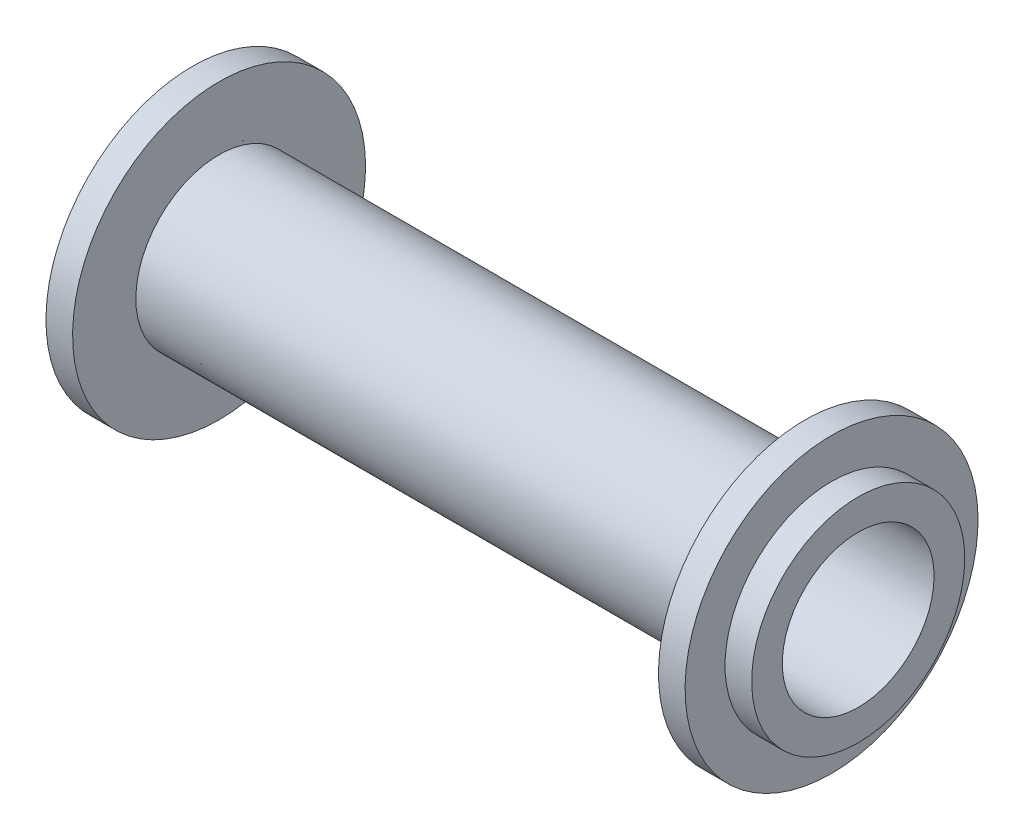
ISO-10303-21;
HEADER;
FILE_DESCRIPTION(('STEP AP214'),'2;1');
FILE_NAME('part.step','',(''),(''),'','','');
FILE_SCHEMA(('AUTOMOTIVE_DESIGN { 1 0 10303 214 1 1 1 1 }'));
ENDSEC;
DATA;
#1=APPLICATION_CONTEXT('core data for automotive mechanical design processes');
#2=APPLICATION_PROTOCOL_DEFINITION('international standard','automotive_design',2000,#1);
#3=PRODUCT_CONTEXT('',#1,'mechanical');
#4=PRODUCT('Part','Part','',(#3));
#5=PRODUCT_RELATED_PRODUCT_CATEGORY('part','',(#4));
#6=PRODUCT_DEFINITION_FORMATION('','',#4);
#7=PRODUCT_DEFINITION_CONTEXT('part definition',#1,'design');
#8=PRODUCT_DEFINITION('design','',#6,#7);
#9=PRODUCT_DEFINITION_SHAPE('','',#8);
#10=(LENGTH_UNIT() NAMED_UNIT(*) SI_UNIT(.MILLI.,.METRE.));
#11=(NAMED_UNIT(*) PLANE_ANGLE_UNIT() SI_UNIT($,.RADIAN.));
#12=(NAMED_UNIT(*) SI_UNIT($,.STERADIAN.) SOLID_ANGLE_UNIT());
#13=UNCERTAINTY_MEASURE_WITH_UNIT(LENGTH_MEASURE(1.E-05),#10,'distance_accuracy_value','');
#14=(GEOMETRIC_REPRESENTATION_CONTEXT(3) GLOBAL_UNCERTAINTY_ASSIGNED_CONTEXT((#13)) GLOBAL_UNIT_ASSIGNED_CONTEXT((#10,
#11,#12)) REPRESENTATION_CONTEXT('',''));
#15=CARTESIAN_POINT('',(0.,0.,0.));
#16=DIRECTION('',(0.,0.,1.));
#17=DIRECTION('',(1.,0.,0.));
#18=AXIS2_PLACEMENT_3D('',#15,#16,#17);
#19=CARTESIAN_POINT('',(-24.,0.,0.));
#20=DIRECTION('',(1.,0.,0.));
#21=DIRECTION('',(0.,1.,0.));
#22=AXIS2_PLACEMENT_3D('',#19,#20,#21);
#23=PLANE('',#22);
#24=CARTESIAN_POINT('',(-24.,0.,0.));
#25=DIRECTION('',(-1.,0.,0.));
#26=DIRECTION('',(0.,-1.,0.));
#27=AXIS2_PLACEMENT_3D('',#24,#25,#26);
#28=CIRCLE('',#27,11.);
#29=CARTESIAN_POINT('',(-24.,-11.,0.));
#30=VERTEX_POINT('',#29);
#31=EDGE_CURVE('E40',#30,#30,#28,.T.);
#32=ORIENTED_EDGE('',*,*,#31,.T.);
#33=EDGE_LOOP('',(#32));
#34=FACE_BOUND('',#33,.T.);
#35=CARTESIAN_POINT('',(-24.,0.,0.));
#36=DIRECTION('',(1.,0.,0.));
#37=DIRECTION('',(0.,1.,0.));
#38=AXIS2_PLACEMENT_3D('',#35,#36,#37);
#39=CIRCLE('',#38,8.);
#40=CARTESIAN_POINT('',(-24.,8.,0.));
#41=VERTEX_POINT('',#40);
#42=EDGE_CURVE('E10',#41,#41,#39,.F.);
#43=ORIENTED_EDGE('',*,*,#42,.F.);
#44=EDGE_LOOP('',(#43));
#45=FACE_BOUND('',#44,.T.);
#46=ADVANCED_FACE('F30',(#34,#45),#23,.F.);
#47=CARTESIAN_POINT('',(24.,0.,0.));
#48=DIRECTION('',(-1.,0.,0.));
#49=DIRECTION('',(0.,-1.,0.));
#50=AXIS2_PLACEMENT_3D('',#47,#48,#49);
#51=PLANE('',#50);
#52=CARTESIAN_POINT('',(24.,0.,0.));
#53=DIRECTION('',(-1.,0.,0.));
#54=DIRECTION('',(0.,-1.,0.));
#55=AXIS2_PLACEMENT_3D('',#52,#53,#54);
#56=CIRCLE('',#55,11.);
#57=CARTESIAN_POINT('',(24.,-11.,0.));
#58=VERTEX_POINT('',#57);
#59=EDGE_CURVE('E58',#58,#58,#56,.T.);
#60=ORIENTED_EDGE('',*,*,#59,.F.);
#61=EDGE_LOOP('',(#60));
#62=FACE_BOUND('',#61,.T.);
#63=CARTESIAN_POINT('',(24.,0.,0.));
#64=DIRECTION('',(-1.,0.,0.));
#65=DIRECTION('',(0.,-1.,0.));
#66=AXIS2_PLACEMENT_3D('',#63,#64,#65);
#67=CIRCLE('',#66,8.);
#68=CARTESIAN_POINT('',(24.,-8.,0.));
#69=VERTEX_POINT('',#68);
#70=EDGE_CURVE('E36',#69,#69,#67,.F.);
#71=ORIENTED_EDGE('',*,*,#70,.F.);
#72=EDGE_LOOP('',(#71));
#73=FACE_BOUND('',#72,.T.);
#74=ADVANCED_FACE('F92',(#62,#73),#51,.F.);
#75=CARTESIAN_POINT('',(-24.,0.,0.));
#76=DIRECTION('',(-1.,0.,0.));
#77=DIRECTION('',(0.,-1.,0.));
#78=AXIS2_PLACEMENT_3D('',#75,#76,#77);
#79=CYLINDRICAL_SURFACE('',#78,11.);
#80=ORIENTED_EDGE('',*,*,#31,.F.);
#81=EDGE_LOOP('',(#80));
#82=FACE_BOUND('',#81,.T.);
#83=CARTESIAN_POINT('',(-22.,0.,0.));
#84=DIRECTION('',(-1.,0.,0.));
#85=DIRECTION('',(0.,-1.,0.));
#86=AXIS2_PLACEMENT_3D('',#83,#84,#85);
#87=CIRCLE('',#86,11.);
#88=CARTESIAN_POINT('',(-22.,-11.,0.));
#89=VERTEX_POINT('',#88);
#90=EDGE_CURVE('E44',#89,#89,#87,.T.);
#91=ORIENTED_EDGE('',*,*,#90,.T.);
#92=EDGE_LOOP('',(#91));
#93=FACE_BOUND('',#92,.T.);
#94=ADVANCED_FACE('F97',(#82,#93),#79,.T.);
#95=CARTESIAN_POINT('',(-22.,11.,0.));
#96=DIRECTION('',(-1.,0.,0.));
#97=DIRECTION('',(0.,-1.,0.));
#98=AXIS2_PLACEMENT_3D('',#95,#96,#97);
#99=PLANE('',#98);
#100=ORIENTED_EDGE('',*,*,#90,.F.);
#101=EDGE_LOOP('',(#100));
#102=FACE_BOUND('',#101,.T.);
#103=CARTESIAN_POINT('',(-22.,0.,0.));
#104=DIRECTION('',(-1.,0.,0.));
#105=DIRECTION('',(0.,-1.,0.));
#106=AXIS2_PLACEMENT_3D('',#103,#104,#105);
#107=CIRCLE('',#106,6.25);
#108=CARTESIAN_POINT('',(-22.,-6.25,0.));
#109=VERTEX_POINT('',#108);
#110=EDGE_CURVE('E49',#109,#109,#107,.T.);
#111=ORIENTED_EDGE('',*,*,#110,.T.);
#112=EDGE_LOOP('',(#111));
#113=FACE_BOUND('',#112,.T.);
#114=ADVANCED_FACE('F105',(#102,#113),#99,.F.);
#115=CARTESIAN_POINT('',(-24.,0.,0.));
#116=DIRECTION('',(-1.,0.,0.));
#117=DIRECTION('',(0.,-1.,0.));
#118=AXIS2_PLACEMENT_3D('',#115,#116,#117);
#119=CYLINDRICAL_SURFACE('',#118,6.25);
#120=ORIENTED_EDGE('',*,*,#110,.F.);
#121=EDGE_LOOP('',(#120));
#122=FACE_BOUND('',#121,.T.);
#123=CARTESIAN_POINT('',(21.9999999999999,0.,0.));
#124=DIRECTION('',(-1.,0.,0.));
#125=DIRECTION('',(0.,-1.,0.));
#126=AXIS2_PLACEMENT_3D('',#123,#124,#125);
#127=CIRCLE('',#126,6.25);
#128=CARTESIAN_POINT('',(21.9999999999999,-6.24999999999999,0.));
#129=VERTEX_POINT('',#128);
#130=EDGE_CURVE('E52',#129,#129,#127,.T.);
#131=ORIENTED_EDGE('',*,*,#130,.T.);
#132=EDGE_LOOP('',(#131));
#133=FACE_BOUND('',#132,.T.);
#134=ADVANCED_FACE('F110',(#122,#133),#119,.T.);
#135=CARTESIAN_POINT('',(22.,11.,0.));
#136=DIRECTION('',(1.,0.,0.));
#137=DIRECTION('',(0.,1.,0.));
#138=AXIS2_PLACEMENT_3D('',#135,#136,#137);
#139=PLANE('',#138);
#140=ORIENTED_EDGE('',*,*,#130,.F.);
#141=EDGE_LOOP('',(#140));
#142=FACE_BOUND('',#141,.T.);
#143=CARTESIAN_POINT('',(22.,0.,0.));
#144=DIRECTION('',(-1.,0.,0.));
#145=DIRECTION('',(0.,-1.,0.));
#146=AXIS2_PLACEMENT_3D('',#143,#144,#145);
#147=CIRCLE('',#146,11.);
#148=CARTESIAN_POINT('',(22.,-11.,0.));
#149=VERTEX_POINT('',#148);
#150=EDGE_CURVE('E55',#149,#149,#147,.T.);
#151=ORIENTED_EDGE('',*,*,#150,.T.);
#152=EDGE_LOOP('',(#151));
#153=FACE_BOUND('',#152,.T.);
#154=ADVANCED_FACE('F116',(#142,#153),#139,.F.);
#155=CARTESIAN_POINT('',(-24.,0.,0.));
#156=DIRECTION('',(-1.,0.,0.));
#157=DIRECTION('',(0.,-1.,0.));
#158=AXIS2_PLACEMENT_3D('',#155,#156,#157);
#159=CYLINDRICAL_SURFACE('',#158,11.);
#160=ORIENTED_EDGE('',*,*,#150,.F.);
#161=EDGE_LOOP('',(#160));
#162=FACE_BOUND('',#161,.T.);
#163=ORIENTED_EDGE('',*,*,#59,.T.);
#164=EDGE_LOOP('',(#163));
#165=FACE_BOUND('',#164,.T.);
#166=ADVANCED_FACE('F122',(#162,#165),#159,.T.);
#167=CARTESIAN_POINT('',(-24.,0.,0.));
#168=DIRECTION('',(1.,0.,0.));
#169=DIRECTION('',(0.,0.,-1.));
#170=AXIS2_PLACEMENT_3D('',#167,#168,#169);
#171=CYLINDRICAL_SURFACE('',#170,5.7);
#172=CARTESIAN_POINT('',(26.,0.,0.));
#173=DIRECTION('',(1.,0.,0.));
#174=DIRECTION('',(0.,0.,-1.));
#175=AXIS2_PLACEMENT_3D('',#172,#173,#174);
#176=CIRCLE('',#175,5.7);
#177=CARTESIAN_POINT('',(26.,0.,-5.7));
#178=VERTEX_POINT('',#177);
#179=EDGE_CURVE('E64',#178,#178,#176,.T.);
#180=ORIENTED_EDGE('',*,*,#179,.T.);
#181=EDGE_LOOP('',(#180));
#182=FACE_BOUND('',#181,.T.);
#183=CARTESIAN_POINT('',(-26.,0.,0.));
#184=DIRECTION('',(-1.,0.,0.));
#185=DIRECTION('',(0.,0.,1.));
#186=AXIS2_PLACEMENT_3D('',#183,#184,#185);
#187=CIRCLE('',#186,5.7);
#188=CARTESIAN_POINT('',(-26.,0.,5.7));
#189=VERTEX_POINT('',#188);
#190=EDGE_CURVE('E70',#189,#189,#187,.T.);
#191=ORIENTED_EDGE('',*,*,#190,.T.);
#192=EDGE_LOOP('',(#191));
#193=FACE_BOUND('',#192,.T.);
#194=ADVANCED_FACE('F74',(#182,#193),#171,.F.);
#195=CARTESIAN_POINT('',(26.,0.,0.));
#196=DIRECTION('',(1.,0.,0.));
#197=DIRECTION('',(0.,0.,-1.));
#198=AXIS2_PLACEMENT_3D('',#195,#196,#197);
#199=PLANE('',#198);
#200=CARTESIAN_POINT('',(26.,0.,0.));
#201=DIRECTION('',(1.,0.,0.));
#202=DIRECTION('',(0.,0.,-1.));
#203=AXIS2_PLACEMENT_3D('',#200,#201,#202);
#204=CIRCLE('',#203,8.);
#205=CARTESIAN_POINT('',(26.,0.,-8.));
#206=VERTEX_POINT('',#205);
#207=EDGE_CURVE('E61',#206,#206,#204,.T.);
#208=ORIENTED_EDGE('',*,*,#207,.T.);
#209=EDGE_LOOP('',(#208));
#210=FACE_BOUND('',#209,.T.);
#211=ORIENTED_EDGE('',*,*,#179,.F.);
#212=EDGE_LOOP('',(#211));
#213=FACE_BOUND('',#212,.T.);
#214=ADVANCED_FACE('F88',(#210,#213),#199,.T.);
#215=CARTESIAN_POINT('',(26.,0.,0.));
#216=DIRECTION('',(-1.,0.,0.));
#217=DIRECTION('',(0.,0.,1.));
#218=AXIS2_PLACEMENT_3D('',#215,#216,#217);
#219=CYLINDRICAL_SURFACE('',#218,8.);
#220=ORIENTED_EDGE('',*,*,#207,.F.);
#221=EDGE_LOOP('',(#220));
#222=FACE_BOUND('',#221,.T.);
#223=ORIENTED_EDGE('',*,*,#70,.T.);
#224=EDGE_LOOP('',(#223));
#225=FACE_BOUND('',#224,.T.);
#226=ADVANCED_FACE('F79',(#222,#225),#219,.T.);
#227=CARTESIAN_POINT('',(-26.,0.,0.));
#228=DIRECTION('',(-1.,0.,0.));
#229=DIRECTION('',(0.,0.,1.));
#230=AXIS2_PLACEMENT_3D('',#227,#228,#229);
#231=PLANE('',#230);
#232=CARTESIAN_POINT('',(-26.,0.,0.));
#233=DIRECTION('',(-1.,0.,0.));
#234=DIRECTION('',(0.,0.,1.));
#235=AXIS2_PLACEMENT_3D('',#232,#233,#234);
#236=CIRCLE('',#235,8.);
#237=CARTESIAN_POINT('',(-26.,0.,8.));
#238=VERTEX_POINT('',#237);
#239=EDGE_CURVE('E67',#238,#238,#236,.T.);
#240=ORIENTED_EDGE('',*,*,#239,.T.);
#241=EDGE_LOOP('',(#240));
#242=FACE_BOUND('',#241,.T.);
#243=ORIENTED_EDGE('',*,*,#190,.F.);
#244=EDGE_LOOP('',(#243));
#245=FACE_BOUND('',#244,.T.);
#246=ADVANCED_FACE('F76',(#242,#245),#231,.T.);
#247=CARTESIAN_POINT('',(-26.,0.,0.));
#248=DIRECTION('',(1.,0.,0.));
#249=DIRECTION('',(0.,0.,-1.));
#250=AXIS2_PLACEMENT_3D('',#247,#248,#249);
#251=CYLINDRICAL_SURFACE('',#250,8.);
#252=ORIENTED_EDGE('',*,*,#239,.F.);
#253=EDGE_LOOP('',(#252));
#254=FACE_BOUND('',#253,.T.);
#255=ORIENTED_EDGE('',*,*,#42,.T.);
#256=EDGE_LOOP('',(#255));
#257=FACE_BOUND('',#256,.T.);
#258=ADVANCED_FACE('F78',(#254,#257),#251,.T.);
#259=CLOSED_SHELL('',(#46,#74,#94,#114,#134,#154,#166,#194,#214,#226,#246,#258));
#260=MANIFOLD_SOLID_BREP('B2',#259);
#261=ADVANCED_BREP_SHAPE_REPRESENTATION('',(#18,#260),#14);
#262=SHAPE_DEFINITION_REPRESENTATION(#9,#261);
ENDSEC;
END-ISO-10303-21;
